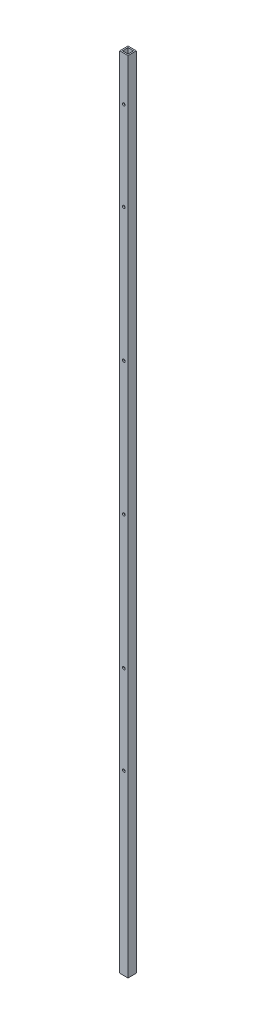
ISO-10303-21;
HEADER;
FILE_DESCRIPTION(('STEP AP214'),'2;1');
FILE_NAME('part.step','',(''),(''),'','','');
FILE_SCHEMA(('AUTOMOTIVE_DESIGN { 1 0 10303 214 1 1 1 1 }'));
ENDSEC;
DATA;
#1=APPLICATION_CONTEXT('core data for automotive mechanical design processes');
#2=APPLICATION_PROTOCOL_DEFINITION('international standard','automotive_design',2000,#1);
#3=PRODUCT_CONTEXT('',#1,'mechanical');
#4=PRODUCT('Part','Part','',(#3));
#5=PRODUCT_RELATED_PRODUCT_CATEGORY('part','',(#4));
#6=PRODUCT_DEFINITION_FORMATION('','',#4);
#7=PRODUCT_DEFINITION_CONTEXT('part definition',#1,'design');
#8=PRODUCT_DEFINITION('design','',#6,#7);
#9=PRODUCT_DEFINITION_SHAPE('','',#8);
#10=(LENGTH_UNIT() NAMED_UNIT(*) SI_UNIT(.MILLI.,.METRE.));
#11=(NAMED_UNIT(*) PLANE_ANGLE_UNIT() SI_UNIT($,.RADIAN.));
#12=(NAMED_UNIT(*) SI_UNIT($,.STERADIAN.) SOLID_ANGLE_UNIT());
#13=UNCERTAINTY_MEASURE_WITH_UNIT(LENGTH_MEASURE(1.E-05),#10,'distance_accuracy_value','');
#14=(GEOMETRIC_REPRESENTATION_CONTEXT(3) GLOBAL_UNCERTAINTY_ASSIGNED_CONTEXT((#13)) GLOBAL_UNIT_ASSIGNED_CONTEXT((#10,
#11,#12)) REPRESENTATION_CONTEXT('',''));
#15=CARTESIAN_POINT('',(0.,0.,0.));
#16=DIRECTION('',(0.,0.,1.));
#17=DIRECTION('',(1.,0.,0.));
#18=AXIS2_PLACEMENT_3D('',#15,#16,#17);
#19=CARTESIAN_POINT('',(0.,1828.8,0.));
#20=DIRECTION('',(1.,0.,0.));
#21=DIRECTION('',(0.,0.,-1.));
#22=AXIS2_PLACEMENT_3D('',#19,#20,#21);
#23=PLANE('',#22);
#24=DIRECTION('',(0.,0.,1.));
#25=VECTOR('',#24,1.);
#26=CARTESIAN_POINT('',(0.,0.,0.));
#27=LINE('',#26,#25);
#28=CARTESIAN_POINT('',(0.,0.,-19.05));
#29=VERTEX_POINT('',#28);
#30=CARTESIAN_POINT('',(0.,0.,0.));
#31=VERTEX_POINT('',#30);
#32=EDGE_CURVE('E158',#29,#31,#27,.T.);
#33=ORIENTED_EDGE('',*,*,#32,.T.);
#34=DIRECTION('',(0.,-1.,0.));
#35=VECTOR('',#34,1.);
#36=CARTESIAN_POINT('',(0.,1828.8,0.));
#37=LINE('',#36,#35);
#38=CARTESIAN_POINT('',(0.,1828.8,0.));
#39=VERTEX_POINT('',#38);
#40=EDGE_CURVE('E11',#39,#31,#37,.T.);
#41=ORIENTED_EDGE('',*,*,#40,.F.);
#42=DIRECTION('',(0.,0.,1.));
#43=VECTOR('',#42,1.);
#44=CARTESIAN_POINT('',(0.,1828.8,0.));
#45=LINE('',#44,#43);
#46=CARTESIAN_POINT('',(0.,1828.8,-19.05));
#47=VERTEX_POINT('',#46);
#48=EDGE_CURVE('E164',#47,#39,#45,.T.);
#49=ORIENTED_EDGE('',*,*,#48,.F.);
#50=DIRECTION('',(0.,-1.,0.));
#51=VECTOR('',#50,1.);
#52=CARTESIAN_POINT('',(0.,1828.8,-19.05));
#53=LINE('',#52,#51);
#54=EDGE_CURVE('E178',#47,#29,#53,.T.);
#55=ORIENTED_EDGE('',*,*,#54,.T.);
#56=EDGE_LOOP('',(#33,#41,#49,#55));
#57=FACE_BOUND('',#56,.T.);
#58=ADVANCED_FACE('F45',(#57),#23,.F.);
#59=CARTESIAN_POINT('',(0.,1828.8,0.));
#60=DIRECTION('',(0.,0.,-1.));
#61=DIRECTION('',(-1.,0.,0.));
#62=AXIS2_PLACEMENT_3D('',#59,#60,#61);
#63=PLANE('',#62);
#64=CARTESIAN_POINT('',(9.525,1727.2,0.));
#65=DIRECTION('',(0.,0.,1.));
#66=DIRECTION('',(1.,0.,0.));
#67=AXIS2_PLACEMENT_3D('',#64,#65,#66);
#68=CIRCLE('',#67,3.17500000000009);
#69=CARTESIAN_POINT('',(12.7000000000001,1727.2,0.));
#70=VERTEX_POINT('',#69);
#71=EDGE_CURVE('E276',#70,#70,#68,.T.);
#72=ORIENTED_EDGE('',*,*,#71,.F.);
#73=EDGE_LOOP('',(#72));
#74=FACE_BOUND('',#73,.T.);
#75=CARTESIAN_POINT('',(9.525,609.6,0.));
#76=DIRECTION('',(0.,0.,1.));
#77=DIRECTION('',(1.,0.,0.));
#78=AXIS2_PLACEMENT_3D('',#75,#76,#77);
#79=CIRCLE('',#78,3.175);
#80=CARTESIAN_POINT('',(12.7,609.6,0.));
#81=VERTEX_POINT('',#80);
#82=EDGE_CURVE('E248',#81,#81,#79,.T.);
#83=ORIENTED_EDGE('',*,*,#82,.F.);
#84=EDGE_LOOP('',(#83));
#85=FACE_BOUND('',#84,.T.);
#86=CARTESIAN_POINT('',(9.525,406.4,0.));
#87=DIRECTION('',(0.,0.,1.));
#88=DIRECTION('',(1.,0.,0.));
#89=AXIS2_PLACEMENT_3D('',#86,#87,#88);
#90=CIRCLE('',#89,3.175);
#91=CARTESIAN_POINT('',(12.7,406.4,0.));
#92=VERTEX_POINT('',#91);
#93=EDGE_CURVE('E247',#92,#92,#90,.T.);
#94=ORIENTED_EDGE('',*,*,#93,.F.);
#95=EDGE_LOOP('',(#94));
#96=FACE_BOUND('',#95,.T.);
#97=CARTESIAN_POINT('',(9.525,914.4,0.));
#98=DIRECTION('',(0.,0.,1.));
#99=DIRECTION('',(1.,0.,0.));
#100=AXIS2_PLACEMENT_3D('',#97,#98,#99);
#101=CIRCLE('',#100,3.17500000000003);
#102=CARTESIAN_POINT('',(12.7,914.4,0.));
#103=VERTEX_POINT('',#102);
#104=EDGE_CURVE('E256',#103,#103,#101,.T.);
#105=ORIENTED_EDGE('',*,*,#104,.F.);
#106=EDGE_LOOP('',(#105));
#107=FACE_BOUND('',#106,.T.);
#108=CARTESIAN_POINT('',(9.525,1219.2,0.));
#109=DIRECTION('',(0.,0.,1.));
#110=DIRECTION('',(1.,0.,0.));
#111=AXIS2_PLACEMENT_3D('',#108,#109,#110);
#112=CIRCLE('',#111,3.17500000000006);
#113=CARTESIAN_POINT('',(12.7000000000001,1219.2,0.));
#114=VERTEX_POINT('',#113);
#115=EDGE_CURVE('E264',#114,#114,#112,.T.);
#116=ORIENTED_EDGE('',*,*,#115,.F.);
#117=EDGE_LOOP('',(#116));
#118=FACE_BOUND('',#117,.T.);
#119=CARTESIAN_POINT('',(9.525,1524.,0.));
#120=DIRECTION('',(0.,0.,1.));
#121=DIRECTION('',(1.,0.,0.));
#122=AXIS2_PLACEMENT_3D('',#119,#120,#121);
#123=CIRCLE('',#122,3.17500000000006);
#124=CARTESIAN_POINT('',(12.7000000000001,1524.,0.));
#125=VERTEX_POINT('',#124);
#126=EDGE_CURVE('E272',#125,#125,#123,.T.);
#127=ORIENTED_EDGE('',*,*,#126,.F.);
#128=EDGE_LOOP('',(#127));
#129=FACE_BOUND('',#128,.T.);
#130=DIRECTION('',(1.,0.,0.));
#131=VECTOR('',#130,1.);
#132=CARTESIAN_POINT('',(0.,0.,0.));
#133=LINE('',#132,#131);
#134=CARTESIAN_POINT('',(19.05,0.,0.));
#135=VERTEX_POINT('',#134);
#136=EDGE_CURVE('E182',#31,#135,#133,.T.);
#137=ORIENTED_EDGE('',*,*,#136,.T.);
#138=DIRECTION('',(0.,-1.,0.));
#139=VECTOR('',#138,1.);
#140=CARTESIAN_POINT('',(19.05,1828.8,0.));
#141=LINE('',#140,#139);
#142=CARTESIAN_POINT('',(19.05,1828.8,0.));
#143=VERTEX_POINT('',#142);
#144=EDGE_CURVE('E54',#143,#135,#141,.T.);
#145=ORIENTED_EDGE('',*,*,#144,.F.);
#146=DIRECTION('',(1.,0.,0.));
#147=VECTOR('',#146,1.);
#148=CARTESIAN_POINT('',(0.,1828.8,0.));
#149=LINE('',#148,#147);
#150=EDGE_CURVE('E168',#39,#143,#149,.T.);
#151=ORIENTED_EDGE('',*,*,#150,.F.);
#152=ORIENTED_EDGE('',*,*,#40,.T.);
#153=EDGE_LOOP('',(#137,#145,#151,#152));
#154=FACE_BOUND('',#153,.T.);
#155=ADVANCED_FACE('F325',(#74,#85,#96,#107,#118,#129,#154),#63,.F.);
#156=CARTESIAN_POINT('',(19.05,1828.8,0.));
#157=DIRECTION('',(-1.,0.,0.));
#158=DIRECTION('',(0.,0.,1.));
#159=AXIS2_PLACEMENT_3D('',#156,#157,#158);
#160=PLANE('',#159);
#161=DIRECTION('',(0.,0.,-1.));
#162=VECTOR('',#161,1.);
#163=CARTESIAN_POINT('',(19.05,0.,0.));
#164=LINE('',#163,#162);
#165=CARTESIAN_POINT('',(19.05,0.,-19.05));
#166=VERTEX_POINT('',#165);
#167=EDGE_CURVE('E185',#135,#166,#164,.T.);
#168=ORIENTED_EDGE('',*,*,#167,.T.);
#169=DIRECTION('',(0.,-1.,0.));
#170=VECTOR('',#169,1.);
#171=CARTESIAN_POINT('',(19.05,1828.8,-19.05));
#172=LINE('',#171,#170);
#173=CARTESIAN_POINT('',(19.05,1828.8,-19.05));
#174=VERTEX_POINT('',#173);
#175=EDGE_CURVE('E193',#174,#166,#172,.T.);
#176=ORIENTED_EDGE('',*,*,#175,.F.);
#177=DIRECTION('',(0.,0.,-1.));
#178=VECTOR('',#177,1.);
#179=CARTESIAN_POINT('',(19.05,1828.8,0.));
#180=LINE('',#179,#178);
#181=EDGE_CURVE('E172',#143,#174,#180,.T.);
#182=ORIENTED_EDGE('',*,*,#181,.F.);
#183=ORIENTED_EDGE('',*,*,#144,.T.);
#184=EDGE_LOOP('',(#168,#176,#182,#183));
#185=FACE_BOUND('',#184,.T.);
#186=ADVANCED_FACE('F331',(#185),#160,.F.);
#187=CARTESIAN_POINT('',(0.,1828.8,-19.05));
#188=DIRECTION('',(0.,0.,1.));
#189=DIRECTION('',(1.,0.,0.));
#190=AXIS2_PLACEMENT_3D('',#187,#188,#189);
#191=PLANE('',#190);
#192=CARTESIAN_POINT('',(9.525,1727.2,-19.05));
#193=DIRECTION('',(0.,0.,1.));
#194=DIRECTION('',(1.,0.,0.));
#195=AXIS2_PLACEMENT_3D('',#192,#193,#194);
#196=CIRCLE('',#195,3.17500000000009);
#197=CARTESIAN_POINT('',(12.7000000000001,1727.2,-19.05));
#198=VERTEX_POINT('',#197);
#199=EDGE_CURVE('E205',#198,#198,#196,.T.);
#200=ORIENTED_EDGE('',*,*,#199,.T.);
#201=EDGE_LOOP('',(#200));
#202=FACE_BOUND('',#201,.T.);
#203=CARTESIAN_POINT('',(9.525,609.6,-19.05));
#204=DIRECTION('',(0.,0.,1.));
#205=DIRECTION('',(1.,0.,0.));
#206=AXIS2_PLACEMENT_3D('',#203,#204,#205);
#207=CIRCLE('',#206,3.175);
#208=CARTESIAN_POINT('',(12.7,609.6,-19.05));
#209=VERTEX_POINT('',#208);
#210=EDGE_CURVE('E277',#209,#209,#207,.T.);
#211=ORIENTED_EDGE('',*,*,#210,.T.);
#212=EDGE_LOOP('',(#211));
#213=FACE_BOUND('',#212,.T.);
#214=CARTESIAN_POINT('',(9.525,406.4,-19.05));
#215=DIRECTION('',(0.,0.,1.));
#216=DIRECTION('',(1.,0.,0.));
#217=AXIS2_PLACEMENT_3D('',#214,#215,#216);
#218=CIRCLE('',#217,3.175);
#219=CARTESIAN_POINT('',(12.7,406.4,-19.05));
#220=VERTEX_POINT('',#219);
#221=EDGE_CURVE('E243',#220,#220,#218,.T.);
#222=ORIENTED_EDGE('',*,*,#221,.T.);
#223=EDGE_LOOP('',(#222));
#224=FACE_BOUND('',#223,.T.);
#225=CARTESIAN_POINT('',(9.525,914.4,-19.05));
#226=DIRECTION('',(0.,0.,1.));
#227=DIRECTION('',(1.,0.,0.));
#228=AXIS2_PLACEMENT_3D('',#225,#226,#227);
#229=CIRCLE('',#228,3.17500000000003);
#230=CARTESIAN_POINT('',(12.7,914.4,-19.05));
#231=VERTEX_POINT('',#230);
#232=EDGE_CURVE('E252',#231,#231,#229,.T.);
#233=ORIENTED_EDGE('',*,*,#232,.T.);
#234=EDGE_LOOP('',(#233));
#235=FACE_BOUND('',#234,.T.);
#236=CARTESIAN_POINT('',(9.525,1219.2,-19.05));
#237=DIRECTION('',(0.,0.,1.));
#238=DIRECTION('',(1.,0.,0.));
#239=AXIS2_PLACEMENT_3D('',#236,#237,#238);
#240=CIRCLE('',#239,3.17500000000006);
#241=CARTESIAN_POINT('',(12.7000000000001,1219.2,-19.05));
#242=VERTEX_POINT('',#241);
#243=EDGE_CURVE('E260',#242,#242,#240,.T.);
#244=ORIENTED_EDGE('',*,*,#243,.T.);
#245=EDGE_LOOP('',(#244));
#246=FACE_BOUND('',#245,.T.);
#247=CARTESIAN_POINT('',(9.525,1524.,-19.05));
#248=DIRECTION('',(0.,0.,1.));
#249=DIRECTION('',(1.,0.,0.));
#250=AXIS2_PLACEMENT_3D('',#247,#248,#249);
#251=CIRCLE('',#250,3.17500000000006);
#252=CARTESIAN_POINT('',(12.7000000000001,1524.,-19.05));
#253=VERTEX_POINT('',#252);
#254=EDGE_CURVE('E268',#253,#253,#251,.T.);
#255=ORIENTED_EDGE('',*,*,#254,.T.);
#256=EDGE_LOOP('',(#255));
#257=FACE_BOUND('',#256,.T.);
#258=DIRECTION('',(-1.,0.,0.));
#259=VECTOR('',#258,1.);
#260=CARTESIAN_POINT('',(0.,0.,-19.05));
#261=LINE('',#260,#259);
#262=EDGE_CURVE('E169',#166,#29,#261,.T.);
#263=ORIENTED_EDGE('',*,*,#262,.T.);
#264=ORIENTED_EDGE('',*,*,#54,.F.);
#265=DIRECTION('',(-1.,0.,0.));
#266=VECTOR('',#265,1.);
#267=CARTESIAN_POINT('',(0.,1828.8,-19.05));
#268=LINE('',#267,#266);
#269=EDGE_CURVE('E175',#174,#47,#268,.T.);
#270=ORIENTED_EDGE('',*,*,#269,.F.);
#271=ORIENTED_EDGE('',*,*,#175,.T.);
#272=EDGE_LOOP('',(#263,#264,#270,#271));
#273=FACE_BOUND('',#272,.T.);
#274=ADVANCED_FACE('F291',(#202,#213,#224,#235,#246,#257,#273),#191,.F.);
#275=CARTESIAN_POINT('',(0.,1828.8,0.));
#276=DIRECTION('',(0.,-1.,0.));
#277=DIRECTION('',(0.,0.,-1.));
#278=AXIS2_PLACEMENT_3D('',#275,#276,#277);
#279=PLANE('',#278);
#280=DIRECTION('',(1.,0.,0.));
#281=VECTOR('',#280,1.);
#282=CARTESIAN_POINT('',(3.175,1828.8,-3.175));
#283=LINE('',#282,#281);
#284=CARTESIAN_POINT('',(3.175,1828.8,-3.175));
#285=VERTEX_POINT('',#284);
#286=CARTESIAN_POINT('',(15.875,1828.8,-3.175));
#287=VERTEX_POINT('',#286);
#288=EDGE_CURVE('E149',#285,#287,#283,.T.);
#289=ORIENTED_EDGE('',*,*,#288,.F.);
#290=DIRECTION('',(0.,0.,1.));
#291=VECTOR('',#290,1.);
#292=CARTESIAN_POINT('',(3.175,1828.8,-3.175));
#293=LINE('',#292,#291);
#294=CARTESIAN_POINT('',(3.175,1828.8,-15.875));
#295=VERTEX_POINT('',#294);
#296=EDGE_CURVE('E62',#295,#285,#293,.T.);
#297=ORIENTED_EDGE('',*,*,#296,.F.);
#298=DIRECTION('',(-1.,0.,0.));
#299=VECTOR('',#298,1.);
#300=CARTESIAN_POINT('',(3.175,1828.8,-15.875));
#301=LINE('',#300,#299);
#302=CARTESIAN_POINT('',(15.875,1828.8,-15.875));
#303=VERTEX_POINT('',#302);
#304=EDGE_CURVE('E133',#303,#295,#301,.T.);
#305=ORIENTED_EDGE('',*,*,#304,.F.);
#306=DIRECTION('',(0.,0.,-1.));
#307=VECTOR('',#306,1.);
#308=CARTESIAN_POINT('',(15.875,1828.8,-3.175));
#309=LINE('',#308,#307);
#310=EDGE_CURVE('E137',#287,#303,#309,.T.);
#311=ORIENTED_EDGE('',*,*,#310,.F.);
#312=EDGE_LOOP('',(#289,#297,#305,#311));
#313=FACE_BOUND('',#312,.T.);
#314=ORIENTED_EDGE('',*,*,#48,.T.);
#315=ORIENTED_EDGE('',*,*,#150,.T.);
#316=ORIENTED_EDGE('',*,*,#181,.T.);
#317=ORIENTED_EDGE('',*,*,#269,.T.);
#318=EDGE_LOOP('',(#314,#315,#316,#317));
#319=FACE_BOUND('',#318,.T.);
#320=ADVANCED_FACE('F343',(#313,#319),#279,.F.);
#321=CARTESIAN_POINT('',(0.,0.,0.));
#322=DIRECTION('',(0.,-1.,0.));
#323=DIRECTION('',(0.,0.,-1.));
#324=AXIS2_PLACEMENT_3D('',#321,#322,#323);
#325=PLANE('',#324);
#326=DIRECTION('',(0.,0.,1.));
#327=VECTOR('',#326,1.);
#328=CARTESIAN_POINT('',(3.175,0.,-3.175));
#329=LINE('',#328,#327);
#330=CARTESIAN_POINT('',(3.175,0.,-15.875));
#331=VERTEX_POINT('',#330);
#332=CARTESIAN_POINT('',(3.175,0.,-3.175));
#333=VERTEX_POINT('',#332);
#334=EDGE_CURVE('E114',#331,#333,#329,.T.);
#335=ORIENTED_EDGE('',*,*,#334,.T.);
#336=DIRECTION('',(1.,0.,0.));
#337=VECTOR('',#336,1.);
#338=CARTESIAN_POINT('',(3.175,0.,-3.175));
#339=LINE('',#338,#337);
#340=CARTESIAN_POINT('',(15.875,0.,-3.175));
#341=VERTEX_POINT('',#340);
#342=EDGE_CURVE('E124',#333,#341,#339,.T.);
#343=ORIENTED_EDGE('',*,*,#342,.T.);
#344=DIRECTION('',(0.,0.,-1.));
#345=VECTOR('',#344,1.);
#346=CARTESIAN_POINT('',(15.875,0.,-3.175));
#347=LINE('',#346,#345);
#348=CARTESIAN_POINT('',(15.875,0.,-15.875));
#349=VERTEX_POINT('',#348);
#350=EDGE_CURVE('E70',#341,#349,#347,.T.);
#351=ORIENTED_EDGE('',*,*,#350,.T.);
#352=DIRECTION('',(-1.,0.,0.));
#353=VECTOR('',#352,1.);
#354=CARTESIAN_POINT('',(3.175,0.,-15.875));
#355=LINE('',#354,#353);
#356=EDGE_CURVE('E121',#349,#331,#355,.T.);
#357=ORIENTED_EDGE('',*,*,#356,.T.);
#358=EDGE_LOOP('',(#335,#343,#351,#357));
#359=FACE_BOUND('',#358,.T.);
#360=ORIENTED_EDGE('',*,*,#32,.F.);
#361=ORIENTED_EDGE('',*,*,#262,.F.);
#362=ORIENTED_EDGE('',*,*,#167,.F.);
#363=ORIENTED_EDGE('',*,*,#136,.F.);
#364=EDGE_LOOP('',(#360,#361,#362,#363));
#365=FACE_BOUND('',#364,.T.);
#366=ADVANCED_FACE('F129',(#359,#365),#325,.T.);
#367=CARTESIAN_POINT('',(3.175,0.,-3.175));
#368=DIRECTION('',(-1.,0.,0.));
#369=DIRECTION('',(0.,0.,1.));
#370=AXIS2_PLACEMENT_3D('',#367,#368,#369);
#371=PLANE('',#370);
#372=ORIENTED_EDGE('',*,*,#296,.T.);
#373=DIRECTION('',(0.,1.,0.));
#374=VECTOR('',#373,1.);
#375=CARTESIAN_POINT('',(3.175,0.,-3.175));
#376=LINE('',#375,#374);
#377=EDGE_CURVE('E110',#333,#285,#376,.T.);
#378=ORIENTED_EDGE('',*,*,#377,.F.);
#379=ORIENTED_EDGE('',*,*,#334,.F.);
#380=DIRECTION('',(0.,1.,0.));
#381=VECTOR('',#380,1.);
#382=CARTESIAN_POINT('',(3.175,0.,-15.875));
#383=LINE('',#382,#381);
#384=EDGE_CURVE('E155',#331,#295,#383,.T.);
#385=ORIENTED_EDGE('',*,*,#384,.T.);
#386=EDGE_LOOP('',(#372,#378,#379,#385));
#387=FACE_BOUND('',#386,.T.);
#388=ADVANCED_FACE('F112',(#387),#371,.F.);
#389=CARTESIAN_POINT('',(3.175,0.,-15.875));
#390=DIRECTION('',(0.,0.,-1.));
#391=DIRECTION('',(-1.,0.,0.));
#392=AXIS2_PLACEMENT_3D('',#389,#390,#391);
#393=PLANE('',#392);
#394=CARTESIAN_POINT('',(9.525,1727.2,-15.875));
#395=DIRECTION('',(0.,0.,-1.));
#396=DIRECTION('',(-1.,0.,0.));
#397=AXIS2_PLACEMENT_3D('',#394,#395,#396);
#398=CIRCLE('',#397,3.17500000000009);
#399=CARTESIAN_POINT('',(6.34999999999991,1727.2,-15.875));
#400=VERTEX_POINT('',#399);
#401=EDGE_CURVE('E140',#400,#400,#398,.T.);
#402=ORIENTED_EDGE('',*,*,#401,.T.);
#403=EDGE_LOOP('',(#402));
#404=FACE_BOUND('',#403,.T.);
#405=CARTESIAN_POINT('',(9.525,609.6,-15.875));
#406=DIRECTION('',(0.,0.,-1.));
#407=DIRECTION('',(-1.,0.,0.));
#408=AXIS2_PLACEMENT_3D('',#405,#406,#407);
#409=CIRCLE('',#408,3.175);
#410=CARTESIAN_POINT('',(6.35,609.6,-15.875));
#411=VERTEX_POINT('',#410);
#412=EDGE_CURVE('E223',#411,#411,#409,.T.);
#413=ORIENTED_EDGE('',*,*,#412,.T.);
#414=EDGE_LOOP('',(#413));
#415=FACE_BOUND('',#414,.T.);
#416=CARTESIAN_POINT('',(9.525,406.4,-15.875));
#417=DIRECTION('',(0.,0.,-1.));
#418=DIRECTION('',(-1.,0.,0.));
#419=AXIS2_PLACEMENT_3D('',#416,#417,#418);
#420=CIRCLE('',#419,3.175);
#421=CARTESIAN_POINT('',(6.35,406.4,-15.875));
#422=VERTEX_POINT('',#421);
#423=EDGE_CURVE('E219',#422,#422,#420,.T.);
#424=ORIENTED_EDGE('',*,*,#423,.T.);
#425=EDGE_LOOP('',(#424));
#426=FACE_BOUND('',#425,.T.);
#427=CARTESIAN_POINT('',(9.525,914.4,-15.875));
#428=DIRECTION('',(0.,0.,-1.));
#429=DIRECTION('',(-1.,0.,0.));
#430=AXIS2_PLACEMENT_3D('',#427,#428,#429);
#431=CIRCLE('',#430,3.17500000000003);
#432=CARTESIAN_POINT('',(6.34999999999997,914.4,-15.875));
#433=VERTEX_POINT('',#432);
#434=EDGE_CURVE('E215',#433,#433,#431,.T.);
#435=ORIENTED_EDGE('',*,*,#434,.T.);
#436=EDGE_LOOP('',(#435));
#437=FACE_BOUND('',#436,.T.);
#438=CARTESIAN_POINT('',(9.525,1219.2,-15.875));
#439=DIRECTION('',(0.,0.,-1.));
#440=DIRECTION('',(-1.,0.,0.));
#441=AXIS2_PLACEMENT_3D('',#438,#439,#440);
#442=CIRCLE('',#441,3.17500000000006);
#443=CARTESIAN_POINT('',(6.34999999999994,1219.2,-15.875));
#444=VERTEX_POINT('',#443);
#445=EDGE_CURVE('E210',#444,#444,#442,.T.);
#446=ORIENTED_EDGE('',*,*,#445,.T.);
#447=EDGE_LOOP('',(#446));
#448=FACE_BOUND('',#447,.T.);
#449=CARTESIAN_POINT('',(9.525,1524.,-15.875));
#450=DIRECTION('',(0.,0.,-1.));
#451=DIRECTION('',(-1.,0.,0.));
#452=AXIS2_PLACEMENT_3D('',#449,#450,#451);
#453=CIRCLE('',#452,3.17500000000006);
#454=CARTESIAN_POINT('',(6.34999999999994,1524.,-15.875));
#455=VERTEX_POINT('',#454);
#456=EDGE_CURVE('E204',#455,#455,#453,.T.);
#457=ORIENTED_EDGE('',*,*,#456,.T.);
#458=EDGE_LOOP('',(#457));
#459=FACE_BOUND('',#458,.T.);
#460=ORIENTED_EDGE('',*,*,#304,.T.);
#461=ORIENTED_EDGE('',*,*,#384,.F.);
#462=ORIENTED_EDGE('',*,*,#356,.F.);
#463=DIRECTION('',(0.,1.,0.));
#464=VECTOR('',#463,1.);
#465=CARTESIAN_POINT('',(15.875,0.,-15.875));
#466=LINE('',#465,#464);
#467=EDGE_CURVE('E159',#349,#303,#466,.T.);
#468=ORIENTED_EDGE('',*,*,#467,.T.);
#469=EDGE_LOOP('',(#460,#461,#462,#468));
#470=FACE_BOUND('',#469,.T.);
#471=ADVANCED_FACE('F361',(#404,#415,#426,#437,#448,#459,#470),#393,.F.);
#472=CARTESIAN_POINT('',(15.875,0.,-3.175));
#473=DIRECTION('',(1.,0.,0.));
#474=DIRECTION('',(0.,0.,-1.));
#475=AXIS2_PLACEMENT_3D('',#472,#473,#474);
#476=PLANE('',#475);
#477=ORIENTED_EDGE('',*,*,#310,.T.);
#478=ORIENTED_EDGE('',*,*,#467,.F.);
#479=ORIENTED_EDGE('',*,*,#350,.F.);
#480=DIRECTION('',(0.,1.,0.));
#481=VECTOR('',#480,1.);
#482=CARTESIAN_POINT('',(15.875,0.,-3.175));
#483=LINE('',#482,#481);
#484=EDGE_CURVE('E120',#341,#287,#483,.T.);
#485=ORIENTED_EDGE('',*,*,#484,.T.);
#486=EDGE_LOOP('',(#477,#478,#479,#485));
#487=FACE_BOUND('',#486,.T.);
#488=ADVANCED_FACE('F364',(#487),#476,.F.);
#489=CARTESIAN_POINT('',(3.175,0.,-3.175));
#490=DIRECTION('',(0.,0.,1.));
#491=DIRECTION('',(1.,0.,0.));
#492=AXIS2_PLACEMENT_3D('',#489,#490,#491);
#493=PLANE('',#492);
#494=CARTESIAN_POINT('',(9.525,1727.2,-3.175));
#495=DIRECTION('',(0.,0.,1.));
#496=DIRECTION('',(1.,0.,0.));
#497=AXIS2_PLACEMENT_3D('',#494,#495,#496);
#498=CIRCLE('',#497,3.17500000000009);
#499=CARTESIAN_POINT('',(12.7000000000001,1727.2,-3.175));
#500=VERTEX_POINT('',#499);
#501=EDGE_CURVE('E48',#500,#500,#498,.T.);
#502=ORIENTED_EDGE('',*,*,#501,.T.);
#503=EDGE_LOOP('',(#502));
#504=FACE_BOUND('',#503,.T.);
#505=CARTESIAN_POINT('',(9.525,609.6,-3.175));
#506=DIRECTION('',(0.,0.,1.));
#507=DIRECTION('',(1.,0.,0.));
#508=AXIS2_PLACEMENT_3D('',#505,#506,#507);
#509=CIRCLE('',#508,3.175);
#510=CARTESIAN_POINT('',(12.7,609.6,-3.175));
#511=VERTEX_POINT('',#510);
#512=EDGE_CURVE('E220',#511,#511,#509,.T.);
#513=ORIENTED_EDGE('',*,*,#512,.T.);
#514=EDGE_LOOP('',(#513));
#515=FACE_BOUND('',#514,.T.);
#516=CARTESIAN_POINT('',(9.525,406.4,-3.175));
#517=DIRECTION('',(0.,0.,1.));
#518=DIRECTION('',(1.,0.,0.));
#519=AXIS2_PLACEMENT_3D('',#516,#517,#518);
#520=CIRCLE('',#519,3.175);
#521=CARTESIAN_POINT('',(12.7,406.4,-3.175));
#522=VERTEX_POINT('',#521);
#523=EDGE_CURVE('E216',#522,#522,#520,.T.);
#524=ORIENTED_EDGE('',*,*,#523,.T.);
#525=EDGE_LOOP('',(#524));
#526=FACE_BOUND('',#525,.T.);
#527=CARTESIAN_POINT('',(9.525,914.4,-3.175));
#528=DIRECTION('',(0.,0.,1.));
#529=DIRECTION('',(1.,0.,0.));
#530=AXIS2_PLACEMENT_3D('',#527,#528,#529);
#531=CIRCLE('',#530,3.17500000000003);
#532=CARTESIAN_POINT('',(12.7,914.4,-3.175));
#533=VERTEX_POINT('',#532);
#534=EDGE_CURVE('E211',#533,#533,#531,.T.);
#535=ORIENTED_EDGE('',*,*,#534,.T.);
#536=EDGE_LOOP('',(#535));
#537=FACE_BOUND('',#536,.T.);
#538=CARTESIAN_POINT('',(9.525,1219.2,-3.175));
#539=DIRECTION('',(0.,0.,1.));
#540=DIRECTION('',(1.,0.,0.));
#541=AXIS2_PLACEMENT_3D('',#538,#539,#540);
#542=CIRCLE('',#541,3.17500000000006);
#543=CARTESIAN_POINT('',(12.7000000000001,1219.2,-3.175));
#544=VERTEX_POINT('',#543);
#545=EDGE_CURVE('E206',#544,#544,#542,.T.);
#546=ORIENTED_EDGE('',*,*,#545,.T.);
#547=EDGE_LOOP('',(#546));
#548=FACE_BOUND('',#547,.T.);
#549=CARTESIAN_POINT('',(9.525,1524.,-3.175));
#550=DIRECTION('',(0.,0.,1.));
#551=DIRECTION('',(1.,0.,0.));
#552=AXIS2_PLACEMENT_3D('',#549,#550,#551);
#553=CIRCLE('',#552,3.17500000000006);
#554=CARTESIAN_POINT('',(12.7000000000001,1524.,-3.175));
#555=VERTEX_POINT('',#554);
#556=EDGE_CURVE('E200',#555,#555,#553,.T.);
#557=ORIENTED_EDGE('',*,*,#556,.T.);
#558=EDGE_LOOP('',(#557));
#559=FACE_BOUND('',#558,.T.);
#560=ORIENTED_EDGE('',*,*,#288,.T.);
#561=ORIENTED_EDGE('',*,*,#484,.F.);
#562=ORIENTED_EDGE('',*,*,#342,.F.);
#563=ORIENTED_EDGE('',*,*,#377,.T.);
#564=EDGE_LOOP('',(#560,#561,#562,#563));
#565=FACE_BOUND('',#564,.T.);
#566=ADVANCED_FACE('F125',(#504,#515,#526,#537,#548,#559,#565),#493,.F.);
#567=CARTESIAN_POINT('',(9.525,1524.,-19.05));
#568=DIRECTION('',(0.,0.,1.));
#569=DIRECTION('',(1.,0.,0.));
#570=AXIS2_PLACEMENT_3D('',#567,#568,#569);
#571=CYLINDRICAL_SURFACE('',#570,3.17500000000006);
#572=ORIENTED_EDGE('',*,*,#126,.T.);
#573=EDGE_LOOP('',(#572));
#574=FACE_BOUND('',#573,.T.);
#575=ORIENTED_EDGE('',*,*,#556,.F.);
#576=EDGE_LOOP('',(#575));
#577=FACE_BOUND('',#576,.T.);
#578=ADVANCED_FACE('F320',(#574,#577),#571,.F.);
#579=CARTESIAN_POINT('',(9.525,1219.2,-19.05));
#580=DIRECTION('',(0.,0.,1.));
#581=DIRECTION('',(1.,0.,0.));
#582=AXIS2_PLACEMENT_3D('',#579,#580,#581);
#583=CYLINDRICAL_SURFACE('',#582,3.17500000000006);
#584=ORIENTED_EDGE('',*,*,#115,.T.);
#585=EDGE_LOOP('',(#584));
#586=FACE_BOUND('',#585,.T.);
#587=ORIENTED_EDGE('',*,*,#545,.F.);
#588=EDGE_LOOP('',(#587));
#589=FACE_BOUND('',#588,.T.);
#590=ADVANCED_FACE('F380',(#586,#589),#583,.F.);
#591=CARTESIAN_POINT('',(9.525,914.4,-19.05));
#592=DIRECTION('',(0.,0.,1.));
#593=DIRECTION('',(1.,0.,0.));
#594=AXIS2_PLACEMENT_3D('',#591,#592,#593);
#595=CYLINDRICAL_SURFACE('',#594,3.17500000000003);
#596=ORIENTED_EDGE('',*,*,#104,.T.);
#597=EDGE_LOOP('',(#596));
#598=FACE_BOUND('',#597,.T.);
#599=ORIENTED_EDGE('',*,*,#534,.F.);
#600=EDGE_LOOP('',(#599));
#601=FACE_BOUND('',#600,.T.);
#602=ADVANCED_FACE('F377',(#598,#601),#595,.F.);
#603=CARTESIAN_POINT('',(9.525,406.4,-19.05));
#604=DIRECTION('',(0.,0.,1.));
#605=DIRECTION('',(1.,0.,0.));
#606=AXIS2_PLACEMENT_3D('',#603,#604,#605);
#607=CYLINDRICAL_SURFACE('',#606,3.175);
#608=ORIENTED_EDGE('',*,*,#93,.T.);
#609=EDGE_LOOP('',(#608));
#610=FACE_BOUND('',#609,.T.);
#611=ORIENTED_EDGE('',*,*,#523,.F.);
#612=EDGE_LOOP('',(#611));
#613=FACE_BOUND('',#612,.T.);
#614=ADVANCED_FACE('F321',(#610,#613),#607,.F.);
#615=CARTESIAN_POINT('',(9.525,609.6,-19.05));
#616=DIRECTION('',(0.,0.,1.));
#617=DIRECTION('',(1.,0.,0.));
#618=AXIS2_PLACEMENT_3D('',#615,#616,#617);
#619=CYLINDRICAL_SURFACE('',#618,3.175);
#620=ORIENTED_EDGE('',*,*,#82,.T.);
#621=EDGE_LOOP('',(#620));
#622=FACE_BOUND('',#621,.T.);
#623=ORIENTED_EDGE('',*,*,#512,.F.);
#624=EDGE_LOOP('',(#623));
#625=FACE_BOUND('',#624,.T.);
#626=ADVANCED_FACE('F311',(#622,#625),#619,.F.);
#627=CARTESIAN_POINT('',(9.525,1727.2,-19.05));
#628=DIRECTION('',(0.,0.,1.));
#629=DIRECTION('',(1.,0.,0.));
#630=AXIS2_PLACEMENT_3D('',#627,#628,#629);
#631=CYLINDRICAL_SURFACE('',#630,3.17500000000009);
#632=ORIENTED_EDGE('',*,*,#71,.T.);
#633=EDGE_LOOP('',(#632));
#634=FACE_BOUND('',#633,.T.);
#635=ORIENTED_EDGE('',*,*,#501,.F.);
#636=EDGE_LOOP('',(#635));
#637=FACE_BOUND('',#636,.T.);
#638=ADVANCED_FACE('F299',(#634,#637),#631,.F.);
#639=ORIENTED_EDGE('',*,*,#254,.F.);
#640=EDGE_LOOP('',(#639));
#641=FACE_BOUND('',#640,.T.);
#642=ORIENTED_EDGE('',*,*,#456,.F.);
#643=EDGE_LOOP('',(#642));
#644=FACE_BOUND('',#643,.T.);
#645=ADVANCED_FACE('F310',(#641,#644),#571,.F.);
#646=ORIENTED_EDGE('',*,*,#243,.F.);
#647=EDGE_LOOP('',(#646));
#648=FACE_BOUND('',#647,.T.);
#649=ORIENTED_EDGE('',*,*,#445,.F.);
#650=EDGE_LOOP('',(#649));
#651=FACE_BOUND('',#650,.T.);
#652=ADVANCED_FACE('F317',(#648,#651),#583,.F.);
#653=ORIENTED_EDGE('',*,*,#232,.F.);
#654=EDGE_LOOP('',(#653));
#655=FACE_BOUND('',#654,.T.);
#656=ORIENTED_EDGE('',*,*,#434,.F.);
#657=EDGE_LOOP('',(#656));
#658=FACE_BOUND('',#657,.T.);
#659=ADVANCED_FACE('F372',(#655,#658),#595,.F.);
#660=ORIENTED_EDGE('',*,*,#221,.F.);
#661=EDGE_LOOP('',(#660));
#662=FACE_BOUND('',#661,.T.);
#663=ORIENTED_EDGE('',*,*,#423,.F.);
#664=EDGE_LOOP('',(#663));
#665=FACE_BOUND('',#664,.T.);
#666=ADVANCED_FACE('F369',(#662,#665),#607,.F.);
#667=ORIENTED_EDGE('',*,*,#210,.F.);
#668=EDGE_LOOP('',(#667));
#669=FACE_BOUND('',#668,.T.);
#670=ORIENTED_EDGE('',*,*,#412,.F.);
#671=EDGE_LOOP('',(#670));
#672=FACE_BOUND('',#671,.T.);
#673=ADVANCED_FACE('F297',(#669,#672),#619,.F.);
#674=ORIENTED_EDGE('',*,*,#199,.F.);
#675=EDGE_LOOP('',(#674));
#676=FACE_BOUND('',#675,.T.);
#677=ORIENTED_EDGE('',*,*,#401,.F.);
#678=EDGE_LOOP('',(#677));
#679=FACE_BOUND('',#678,.T.);
#680=ADVANCED_FACE('F294',(#676,#679),#631,.F.);
#681=CLOSED_SHELL('',(#58,#155,#186,#274,#320,#366,#388,#471,#488,#566,#578,#590,#602,#614,#626,
#638,#645,#652,#659,#666,#673,#680));
#682=MANIFOLD_SOLID_BREP('B2',#681);
#683=ADVANCED_BREP_SHAPE_REPRESENTATION('',(#18,#682),#14);
#684=SHAPE_DEFINITION_REPRESENTATION(#9,#683);
ENDSEC;
END-ISO-10303-21;
